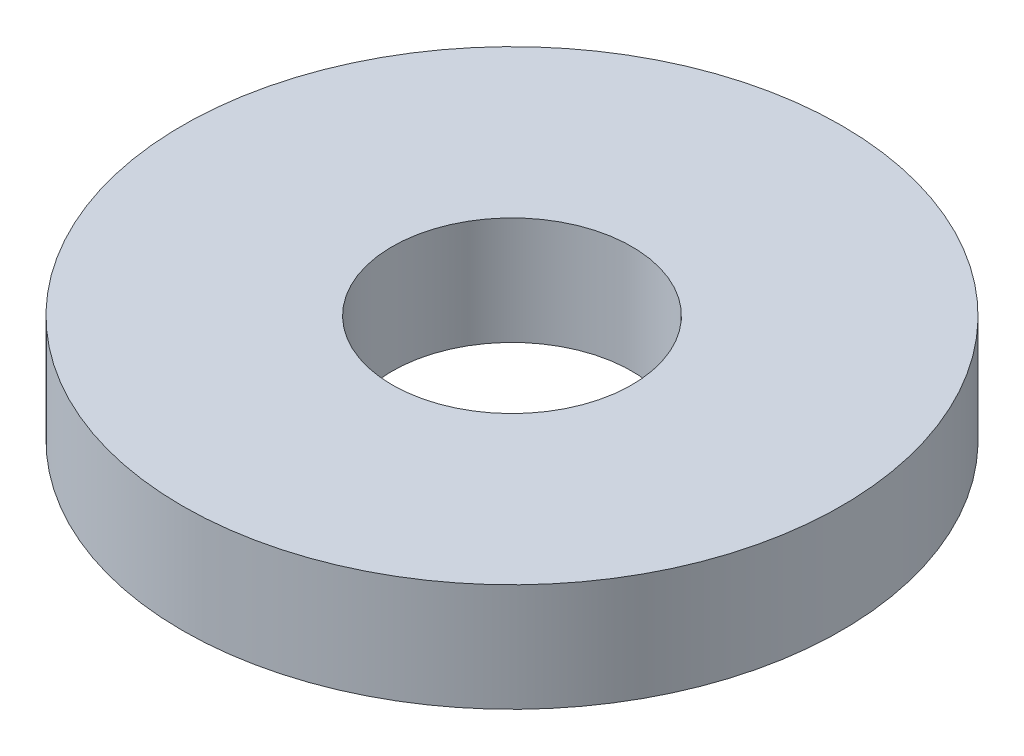
ISO-10303-21;
HEADER;
FILE_DESCRIPTION(('STEP AP214'),'2;1');
FILE_NAME('part.step','',(''),(''),'','','');
FILE_SCHEMA(('AUTOMOTIVE_DESIGN { 1 0 10303 214 1 1 1 1 }'));
ENDSEC;
DATA;
#1=APPLICATION_CONTEXT('core data for automotive mechanical design processes');
#2=APPLICATION_PROTOCOL_DEFINITION('international standard','automotive_design',2000,#1);
#3=PRODUCT_CONTEXT('',#1,'mechanical');
#4=PRODUCT('Part','Part','',(#3));
#5=PRODUCT_RELATED_PRODUCT_CATEGORY('part','',(#4));
#6=PRODUCT_DEFINITION_FORMATION('','',#4);
#7=PRODUCT_DEFINITION_CONTEXT('part definition',#1,'design');
#8=PRODUCT_DEFINITION('design','',#6,#7);
#9=PRODUCT_DEFINITION_SHAPE('','',#8);
#10=(LENGTH_UNIT() NAMED_UNIT(*) SI_UNIT(.MILLI.,.METRE.));
#11=(NAMED_UNIT(*) PLANE_ANGLE_UNIT() SI_UNIT($,.RADIAN.));
#12=(NAMED_UNIT(*) SI_UNIT($,.STERADIAN.) SOLID_ANGLE_UNIT());
#13=UNCERTAINTY_MEASURE_WITH_UNIT(LENGTH_MEASURE(1.E-05),#10,'distance_accuracy_value','');
#14=(GEOMETRIC_REPRESENTATION_CONTEXT(3) GLOBAL_UNCERTAINTY_ASSIGNED_CONTEXT((#13)) GLOBAL_UNIT_ASSIGNED_CONTEXT((#10,
#11,#12)) REPRESENTATION_CONTEXT('',''));
#15=CARTESIAN_POINT('',(0.,0.,0.));
#16=DIRECTION('',(0.,0.,1.));
#17=DIRECTION('',(1.,0.,0.));
#18=AXIS2_PLACEMENT_3D('',#15,#16,#17);
#19=CARTESIAN_POINT('',(0.,9.,0.));
#20=DIRECTION('',(0.,-1.,0.));
#21=DIRECTION('',(0.,0.,-1.));
#22=AXIS2_PLACEMENT_3D('',#19,#20,#21);
#23=CYLINDRICAL_SURFACE('',#22,27.5);
#24=CARTESIAN_POINT('',(0.,9.,0.));
#25=DIRECTION('',(0.,1.,0.));
#26=DIRECTION('',(0.,0.,1.));
#27=AXIS2_PLACEMENT_3D('',#24,#25,#26);
#28=CIRCLE('',#27,27.5);
#29=CARTESIAN_POINT('',(0.,9.,27.5));
#30=VERTEX_POINT('',#29);
#31=EDGE_CURVE('E10',#30,#30,#28,.T.);
#32=ORIENTED_EDGE('',*,*,#31,.F.);
#33=EDGE_LOOP('',(#32));
#34=FACE_BOUND('',#33,.T.);
#35=CARTESIAN_POINT('',(0.,0.,0.));
#36=DIRECTION('',(0.,1.,0.));
#37=DIRECTION('',(0.,0.,1.));
#38=AXIS2_PLACEMENT_3D('',#35,#36,#37);
#39=CIRCLE('',#38,27.5);
#40=CARTESIAN_POINT('',(0.,0.,27.5));
#41=VERTEX_POINT('',#40);
#42=EDGE_CURVE('E37',#41,#41,#39,.T.);
#43=ORIENTED_EDGE('',*,*,#42,.T.);
#44=EDGE_LOOP('',(#43));
#45=FACE_BOUND('',#44,.T.);
#46=ADVANCED_FACE('F40',(#34,#45),#23,.T.);
#47=CARTESIAN_POINT('',(0.,9.,0.));
#48=DIRECTION('',(0.,1.,0.));
#49=DIRECTION('',(0.,0.,1.));
#50=AXIS2_PLACEMENT_3D('',#47,#48,#49);
#51=PLANE('',#50);
#52=CARTESIAN_POINT('',(0.,9.,0.));
#53=DIRECTION('',(0.,1.,0.));
#54=DIRECTION('',(0.,0.,1.));
#55=AXIS2_PLACEMENT_3D('',#52,#53,#54);
#56=CIRCLE('',#55,10.);
#57=CARTESIAN_POINT('',(0.,9.,10.));
#58=VERTEX_POINT('',#57);
#59=EDGE_CURVE('E50',#58,#58,#56,.T.);
#60=ORIENTED_EDGE('',*,*,#59,.F.);
#61=EDGE_LOOP('',(#60));
#62=FACE_BOUND('',#61,.T.);
#63=ORIENTED_EDGE('',*,*,#31,.T.);
#64=EDGE_LOOP('',(#63));
#65=FACE_BOUND('',#64,.T.);
#66=ADVANCED_FACE('F59',(#62,#65),#51,.T.);
#67=CARTESIAN_POINT('',(0.,0.,0.));
#68=DIRECTION('',(0.,1.,0.));
#69=DIRECTION('',(0.,0.,1.));
#70=AXIS2_PLACEMENT_3D('',#67,#68,#69);
#71=PLANE('',#70);
#72=CARTESIAN_POINT('',(0.,0.,0.));
#73=DIRECTION('',(0.,1.,0.));
#74=DIRECTION('',(0.,0.,1.));
#75=AXIS2_PLACEMENT_3D('',#72,#73,#74);
#76=CIRCLE('',#75,10.);
#77=CARTESIAN_POINT('',(0.,0.,10.));
#78=VERTEX_POINT('',#77);
#79=EDGE_CURVE('E47',#78,#78,#76,.T.);
#80=ORIENTED_EDGE('',*,*,#79,.T.);
#81=EDGE_LOOP('',(#80));
#82=FACE_BOUND('',#81,.T.);
#83=ORIENTED_EDGE('',*,*,#42,.F.);
#84=EDGE_LOOP('',(#83));
#85=FACE_BOUND('',#84,.T.);
#86=ADVANCED_FACE('F58',(#82,#85),#71,.F.);
#87=CARTESIAN_POINT('',(0.,9.,0.));
#88=DIRECTION('',(0.,-1.,0.));
#89=DIRECTION('',(0.,0.,-1.));
#90=AXIS2_PLACEMENT_3D('',#87,#88,#89);
#91=CYLINDRICAL_SURFACE('',#90,10.);
#92=ORIENTED_EDGE('',*,*,#59,.T.);
#93=EDGE_LOOP('',(#92));
#94=FACE_BOUND('',#93,.T.);
#95=ORIENTED_EDGE('',*,*,#79,.F.);
#96=EDGE_LOOP('',(#95));
#97=FACE_BOUND('',#96,.T.);
#98=ADVANCED_FACE('F54',(#94,#97),#91,.F.);
#99=CLOSED_SHELL('',(#46,#66,#86,#98));
#100=MANIFOLD_SOLID_BREP('B2',#99);
#101=ADVANCED_BREP_SHAPE_REPRESENTATION('',(#18,#100),#14);
#102=SHAPE_DEFINITION_REPRESENTATION(#9,#101);
ENDSEC;
END-ISO-10303-21;
